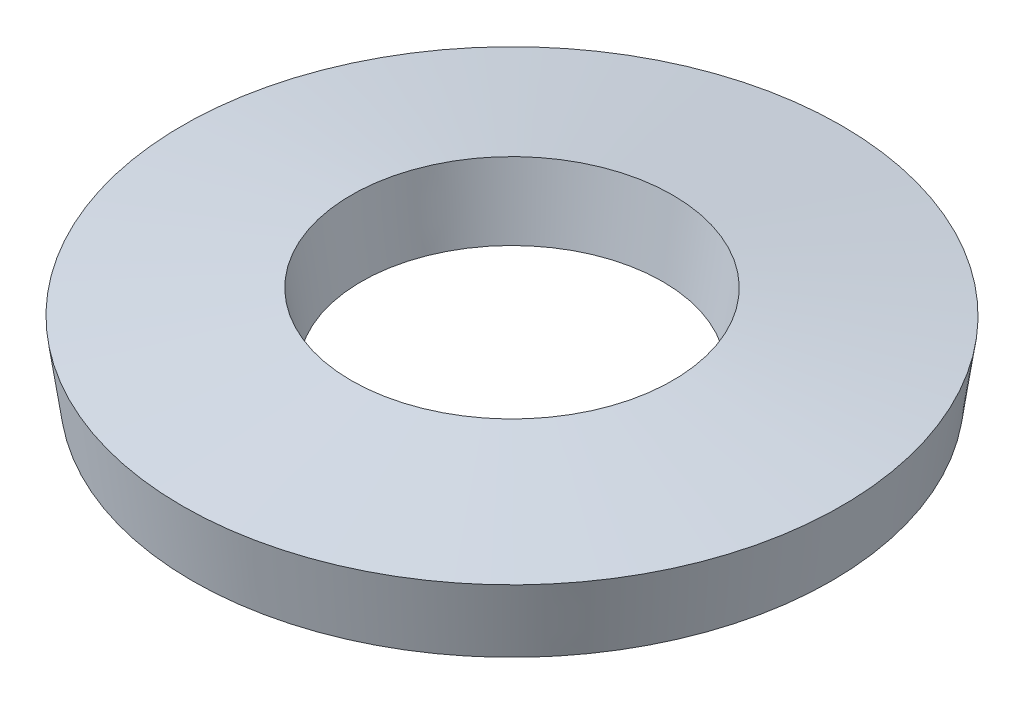
ISO-10303-21;
HEADER;
FILE_DESCRIPTION(('STEP AP214'),'2;1');
FILE_NAME('part.step','',(''),(''),'','','');
FILE_SCHEMA(('AUTOMOTIVE_DESIGN { 1 0 10303 214 1 1 1 1 }'));
ENDSEC;
DATA;
#1=APPLICATION_CONTEXT('core data for automotive mechanical design processes');
#2=APPLICATION_PROTOCOL_DEFINITION('international standard','automotive_design',2000,#1);
#3=PRODUCT_CONTEXT('',#1,'mechanical');
#4=PRODUCT('Part','Part','',(#3));
#5=PRODUCT_RELATED_PRODUCT_CATEGORY('part','',(#4));
#6=PRODUCT_DEFINITION_FORMATION('','',#4);
#7=PRODUCT_DEFINITION_CONTEXT('part definition',#1,'design');
#8=PRODUCT_DEFINITION('design','',#6,#7);
#9=PRODUCT_DEFINITION_SHAPE('','',#8);
#10=(LENGTH_UNIT() NAMED_UNIT(*) SI_UNIT(.MILLI.,.METRE.));
#11=(NAMED_UNIT(*) PLANE_ANGLE_UNIT() SI_UNIT($,.RADIAN.));
#12=(NAMED_UNIT(*) SI_UNIT($,.STERADIAN.) SOLID_ANGLE_UNIT());
#13=UNCERTAINTY_MEASURE_WITH_UNIT(LENGTH_MEASURE(1.E-05),#10,'distance_accuracy_value','');
#14=(GEOMETRIC_REPRESENTATION_CONTEXT(3) GLOBAL_UNCERTAINTY_ASSIGNED_CONTEXT((#13)) GLOBAL_UNIT_ASSIGNED_CONTEXT((#10,
#11,#12)) REPRESENTATION_CONTEXT('',''));
#15=CARTESIAN_POINT('',(0.,0.,0.));
#16=DIRECTION('',(0.,0.,1.));
#17=DIRECTION('',(1.,0.,0.));
#18=AXIS2_PLACEMENT_3D('',#15,#16,#17);
#19=CARTESIAN_POINT('',(0.,0.,0.));
#20=DIRECTION('',(0.,1.,0.));
#21=DIRECTION('',(0.,0.,1.));
#22=AXIS2_PLACEMENT_3D('',#19,#20,#21);
#23=CONICAL_SURFACE('',#22,6.786710012267,0.142676904490485);
#24=CARTESIAN_POINT('',(0.,1.48475835782556,0.));
#25=DIRECTION('',(0.,-1.,0.));
#26=DIRECTION('',(0.,0.,-1.));
#27=AXIS2_PLACEMENT_3D('',#24,#25,#26);
#28=CIRCLE('',#27,7.);
#29=CARTESIAN_POINT('',(0.,1.48475835782556,-7.));
#30=VERTEX_POINT('',#29);
#31=EDGE_CURVE('E54',#30,#30,#28,.T.);
#32=ORIENTED_EDGE('',*,*,#31,.T.);
#33=EDGE_LOOP('',(#32));
#34=FACE_BOUND('',#33,.T.);
#35=CARTESIAN_POINT('',(0.,0.,0.));
#36=DIRECTION('',(0.,-1.,0.));
#37=DIRECTION('',(0.,0.,-1.));
#38=AXIS2_PLACEMENT_3D('',#35,#36,#37);
#39=CIRCLE('',#38,6.786710012267);
#40=CARTESIAN_POINT('',(0.,0.,-6.786710012267));
#41=VERTEX_POINT('',#40);
#42=EDGE_CURVE('E10',#41,#41,#39,.T.);
#43=ORIENTED_EDGE('',*,*,#42,.F.);
#44=EDGE_LOOP('',(#43));
#45=FACE_BOUND('',#44,.T.);
#46=ADVANCED_FACE('F40',(#34,#45),#23,.T.);
#47=CARTESIAN_POINT('',(0.,0.51524164217444,0.));
#48=DIRECTION('',(0.,-1.,0.));
#49=DIRECTION('',(0.,0.,-1.));
#50=AXIS2_PLACEMENT_3D('',#47,#48,#49);
#51=CONICAL_SURFACE('',#50,3.2,1.42811942230441);
#52=ORIENTED_EDGE('',*,*,#42,.T.);
#53=EDGE_LOOP('',(#52));
#54=FACE_BOUND('',#53,.T.);
#55=CARTESIAN_POINT('',(0.,0.51524164217444,0.));
#56=DIRECTION('',(0.,-1.,0.));
#57=DIRECTION('',(0.,0.,-1.));
#58=AXIS2_PLACEMENT_3D('',#55,#56,#57);
#59=CIRCLE('',#58,3.2);
#60=CARTESIAN_POINT('',(0.,0.51524164217444,-3.2));
#61=VERTEX_POINT('',#60);
#62=EDGE_CURVE('E46',#61,#61,#59,.T.);
#63=ORIENTED_EDGE('',*,*,#62,.F.);
#64=EDGE_LOOP('',(#63));
#65=FACE_BOUND('',#64,.T.);
#66=ADVANCED_FACE('F70',(#54,#65),#51,.F.);
#67=CARTESIAN_POINT('',(0.,2.,0.));
#68=DIRECTION('',(0.,1.,0.));
#69=DIRECTION('',(0.,0.,1.));
#70=AXIS2_PLACEMENT_3D('',#67,#68,#69);
#71=CONICAL_SURFACE('',#70,3.413289987733,0.142676904490484);
#72=ORIENTED_EDGE('',*,*,#62,.T.);
#73=EDGE_LOOP('',(#72));
#74=FACE_BOUND('',#73,.T.);
#75=CARTESIAN_POINT('',(0.,2.,0.));
#76=DIRECTION('',(0.,-1.,0.));
#77=DIRECTION('',(0.,0.,-1.));
#78=AXIS2_PLACEMENT_3D('',#75,#76,#77);
#79=CIRCLE('',#78,3.413289987733);
#80=CARTESIAN_POINT('',(0.,2.,-3.413289987733));
#81=VERTEX_POINT('',#80);
#82=EDGE_CURVE('E50',#81,#81,#79,.T.);
#83=ORIENTED_EDGE('',*,*,#82,.F.);
#84=EDGE_LOOP('',(#83));
#85=FACE_BOUND('',#84,.T.);
#86=ADVANCED_FACE('F64',(#74,#85),#71,.F.);
#87=CARTESIAN_POINT('',(0.,1.48475835782556,0.));
#88=DIRECTION('',(0.,-1.,0.));
#89=DIRECTION('',(0.,0.,-1.));
#90=AXIS2_PLACEMENT_3D('',#87,#88,#89);
#91=CONICAL_SURFACE('',#90,7.,1.42811942230441);
#92=ORIENTED_EDGE('',*,*,#82,.T.);
#93=EDGE_LOOP('',(#92));
#94=FACE_BOUND('',#93,.T.);
#95=ORIENTED_EDGE('',*,*,#31,.F.);
#96=EDGE_LOOP('',(#95));
#97=FACE_BOUND('',#96,.T.);
#98=ADVANCED_FACE('F62',(#94,#97),#91,.T.);
#99=CLOSED_SHELL('',(#46,#66,#86,#98));
#100=MANIFOLD_SOLID_BREP('B2',#99);
#101=ADVANCED_BREP_SHAPE_REPRESENTATION('',(#18,#100),#14);
#102=SHAPE_DEFINITION_REPRESENTATION(#9,#101);
ENDSEC;
END-ISO-10303-21;
